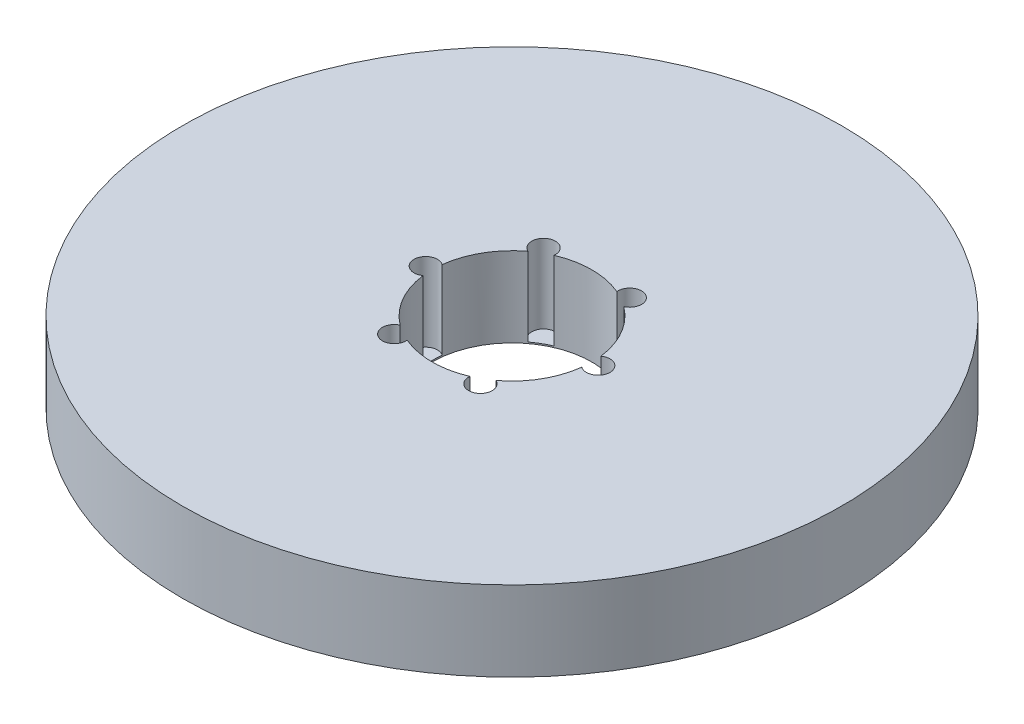
ISO-10303-21;
HEADER;
FILE_DESCRIPTION(('STEP AP214'),'2;1');
FILE_NAME('part.step','',(''),(''),'','','');
FILE_SCHEMA(('AUTOMOTIVE_DESIGN { 1 0 10303 214 1 1 1 1 }'));
ENDSEC;
DATA;
#1=APPLICATION_CONTEXT('core data for automotive mechanical design processes');
#2=APPLICATION_PROTOCOL_DEFINITION('international standard','automotive_design',2000,#1);
#3=PRODUCT_CONTEXT('',#1,'mechanical');
#4=PRODUCT('Part','Part','',(#3));
#5=PRODUCT_RELATED_PRODUCT_CATEGORY('part','',(#4));
#6=PRODUCT_DEFINITION_FORMATION('','',#4);
#7=PRODUCT_DEFINITION_CONTEXT('part definition',#1,'design');
#8=PRODUCT_DEFINITION('design','',#6,#7);
#9=PRODUCT_DEFINITION_SHAPE('','',#8);
#10=(LENGTH_UNIT() NAMED_UNIT(*) SI_UNIT(.MILLI.,.METRE.));
#11=(NAMED_UNIT(*) PLANE_ANGLE_UNIT() SI_UNIT($,.RADIAN.));
#12=(NAMED_UNIT(*) SI_UNIT($,.STERADIAN.) SOLID_ANGLE_UNIT());
#13=UNCERTAINTY_MEASURE_WITH_UNIT(LENGTH_MEASURE(1.E-05),#10,'distance_accuracy_value','');
#14=(GEOMETRIC_REPRESENTATION_CONTEXT(3) GLOBAL_UNCERTAINTY_ASSIGNED_CONTEXT((#13)) GLOBAL_UNIT_ASSIGNED_CONTEXT((#10,
#11,#12)) REPRESENTATION_CONTEXT('',''));
#15=CARTESIAN_POINT('',(0.,0.,0.));
#16=DIRECTION('',(0.,0.,1.));
#17=DIRECTION('',(1.,0.,0.));
#18=AXIS2_PLACEMENT_3D('',#15,#16,#17);
#19=CARTESIAN_POINT('',(0.,20.,0.));
#20=DIRECTION('',(0.,-1.,0.));
#21=DIRECTION('',(0.,0.,-1.));
#22=AXIS2_PLACEMENT_3D('',#19,#20,#21);
#23=CYLINDRICAL_SURFACE('',#22,82.5);
#24=CARTESIAN_POINT('',(0.,20.,0.));
#25=DIRECTION('',(0.,1.,0.));
#26=DIRECTION('',(0.,0.,1.));
#27=AXIS2_PLACEMENT_3D('',#24,#25,#26);
#28=CIRCLE('',#27,82.5);
#29=CARTESIAN_POINT('',(0.,20.,82.5));
#30=VERTEX_POINT('',#29);
#31=EDGE_CURVE('E171',#30,#30,#28,.T.);
#32=ORIENTED_EDGE('',*,*,#31,.F.);
#33=EDGE_LOOP('',(#32));
#34=FACE_BOUND('',#33,.T.);
#35=CARTESIAN_POINT('',(0.,0.,0.));
#36=DIRECTION('',(0.,1.,0.));
#37=DIRECTION('',(0.,0.,1.));
#38=AXIS2_PLACEMENT_3D('',#35,#36,#37);
#39=CIRCLE('',#38,82.5);
#40=CARTESIAN_POINT('',(0.,0.,82.5));
#41=VERTEX_POINT('',#40);
#42=EDGE_CURVE('E157',#41,#41,#39,.T.);
#43=ORIENTED_EDGE('',*,*,#42,.T.);
#44=EDGE_LOOP('',(#43));
#45=FACE_BOUND('',#44,.T.);
#46=ADVANCED_FACE('F39',(#34,#45),#23,.T.);
#47=CARTESIAN_POINT('',(0.,20.,0.));
#48=DIRECTION('',(0.,1.,0.));
#49=DIRECTION('',(0.,0.,1.));
#50=AXIS2_PLACEMENT_3D('',#47,#48,#49);
#51=PLANE('',#50);
#52=CARTESIAN_POINT('',(-10.7906424450801,20.,-18.6899409611874));
#53=DIRECTION('',(0.,1.,0.));
#54=DIRECTION('',(-0.866025403784433,0.,0.50000000000001));
#55=AXIS2_PLACEMENT_3D('',#52,#53,#54);
#56=CIRCLE('',#55,2.94707210080834);
#57=CARTESIAN_POINT('',(-7.85873994580773,20.,-18.391307905208));
#58=VERTEX_POINT('',#57);
#59=CARTESIAN_POINT('',(-11.9979698818282,20.,-16.0015223874088));
#60=VERTEX_POINT('',#59);
#61=EDGE_CURVE('E214',#58,#60,#56,.T.);
#62=ORIENTED_EDGE('',*,*,#61,.F.);
#63=CARTESIAN_POINT('',(0.,20.,0.));
#64=DIRECTION('',(0.,1.,0.));
#65=DIRECTION('',(0.,0.,1.));
#66=AXIS2_PLACEMENT_3D('',#63,#64,#65);
#67=CIRCLE('',#66,20.);
#68=CARTESIAN_POINT('',(7.85873994580735,20.,-18.3913079052082));
#69=VERTEX_POINT('',#68);
#70=EDGE_CURVE('E272',#69,#58,#67,.T.);
#71=ORIENTED_EDGE('',*,*,#70,.F.);
#72=CARTESIAN_POINT('',(10.7906424450797,20.,-18.6899409611876));
#73=DIRECTION('',(0.,1.,0.));
#74=DIRECTION('',(-0.866025403784443,0.,-0.499999999999992));
#75=AXIS2_PLACEMENT_3D('',#72,#73,#74);
#76=CIRCLE('',#75,2.94707210080834);
#77=CARTESIAN_POINT('',(11.9979698818279,20.,-16.001522387409));
#78=VERTEX_POINT('',#77);
#79=EDGE_CURVE('E285',#78,#69,#76,.T.);
#80=ORIENTED_EDGE('',*,*,#79,.F.);
#81=CARTESIAN_POINT('',(19.8567098276355,20.,-2.38978551779919));
#82=VERTEX_POINT('',#81);
#83=EDGE_CURVE('E165',#82,#78,#67,.T.);
#84=ORIENTED_EDGE('',*,*,#83,.F.);
#85=CARTESIAN_POINT('',(21.5812848901597,20.,0.));
#86=DIRECTION('',(0.,1.,0.));
#87=DIRECTION('',(0.,0.,-1.));
#88=AXIS2_PLACEMENT_3D('',#85,#86,#87);
#89=CIRCLE('',#88,2.94707210080834);
#90=CARTESIAN_POINT('',(19.8567098276355,20.,2.38978551779919));
#91=VERTEX_POINT('',#90);
#92=EDGE_CURVE('E281',#91,#82,#89,.T.);
#93=ORIENTED_EDGE('',*,*,#92,.F.);
#94=CARTESIAN_POINT('',(11.9979698818281,20.,16.0015223874088));
#95=VERTEX_POINT('',#94);
#96=EDGE_CURVE('E160',#95,#91,#67,.T.);
#97=ORIENTED_EDGE('',*,*,#96,.F.);
#98=CARTESIAN_POINT('',(10.7906424450799,20.,18.6899409611875));
#99=DIRECTION('',(0.,1.,0.));
#100=DIRECTION('',(0.866025403784436,0.,-0.500000000000004));
#101=AXIS2_PLACEMENT_3D('',#98,#99,#100);
#102=CIRCLE('',#101,2.94707210080834);
#103=CARTESIAN_POINT('',(7.85873994580761,20.,18.391307905208));
#104=VERTEX_POINT('',#103);
#105=EDGE_CURVE('E154',#104,#95,#102,.T.);
#106=ORIENTED_EDGE('',*,*,#105,.F.);
#107=CARTESIAN_POINT('',(-7.85873994580748,20.,18.3913079052081));
#108=VERTEX_POINT('',#107);
#109=EDGE_CURVE('E150',#108,#104,#67,.T.);
#110=ORIENTED_EDGE('',*,*,#109,.F.);
#111=CARTESIAN_POINT('',(-10.7906424450798,20.,18.6899409611876));
#112=DIRECTION('',(0.,1.,0.));
#113=DIRECTION('',(0.86602540378444,0.,0.499999999999998));
#114=AXIS2_PLACEMENT_3D('',#111,#112,#113);
#115=CIRCLE('',#114,2.94707210080834);
#116=CARTESIAN_POINT('',(-11.997969881828,20.,16.0015223874089));
#117=VERTEX_POINT('',#116);
#118=EDGE_CURVE('E127',#117,#108,#115,.T.);
#119=ORIENTED_EDGE('',*,*,#118,.F.);
#120=CARTESIAN_POINT('',(-19.8567098276355,20.,2.38978551779919));
#121=VERTEX_POINT('',#120);
#122=EDGE_CURVE('E156',#121,#117,#67,.T.);
#123=ORIENTED_EDGE('',*,*,#122,.F.);
#124=CARTESIAN_POINT('',(-21.5812848901597,20.,0.));
#125=DIRECTION('',(0.,1.,0.));
#126=DIRECTION('',(0.,0.,1.));
#127=AXIS2_PLACEMENT_3D('',#124,#125,#126);
#128=CIRCLE('',#127,2.94707210080834);
#129=CARTESIAN_POINT('',(-19.8567098276355,20.,-2.38978551779919));
#130=VERTEX_POINT('',#129);
#131=EDGE_CURVE('E164',#130,#121,#128,.T.);
#132=ORIENTED_EDGE('',*,*,#131,.F.);
#133=EDGE_CURVE('E159',#60,#130,#67,.T.);
#134=ORIENTED_EDGE('',*,*,#133,.F.);
#135=EDGE_LOOP('',(#62,#71,#80,#84,#93,#97,#106,#110,#119,#123,#132,#134));
#136=FACE_BOUND('',#135,.T.);
#137=ORIENTED_EDGE('',*,*,#31,.T.);
#138=EDGE_LOOP('',(#137));
#139=FACE_BOUND('',#138,.T.);
#140=ADVANCED_FACE('F155',(#136,#139),#51,.T.);
#141=CARTESIAN_POINT('',(0.,0.,0.));
#142=DIRECTION('',(0.,1.,0.));
#143=DIRECTION('',(0.,0.,1.));
#144=AXIS2_PLACEMENT_3D('',#141,#142,#143);
#145=PLANE('',#144);
#146=CARTESIAN_POINT('',(0.,0.,0.));
#147=DIRECTION('',(0.,1.,0.));
#148=DIRECTION('',(0.,0.,1.));
#149=AXIS2_PLACEMENT_3D('',#146,#147,#148);
#150=CIRCLE('',#149,20.);
#151=CARTESIAN_POINT('',(0.,0.,20.));
#152=VERTEX_POINT('',#151);
#153=EDGE_CURVE('E170',#152,#152,#150,.T.);
#154=ORIENTED_EDGE('',*,*,#153,.T.);
#155=EDGE_LOOP('',(#154));
#156=FACE_BOUND('',#155,.T.);
#157=ORIENTED_EDGE('',*,*,#42,.F.);
#158=EDGE_LOOP('',(#157));
#159=FACE_BOUND('',#158,.T.);
#160=ADVANCED_FACE('F232',(#156,#159),#145,.F.);
#161=CARTESIAN_POINT('',(0.,20.,0.));
#162=DIRECTION('',(0.,-1.,0.));
#163=DIRECTION('',(0.,0.,-1.));
#164=AXIS2_PLACEMENT_3D('',#161,#162,#163);
#165=CYLINDRICAL_SURFACE('',#164,20.);
#166=DIRECTION('',(0.,1.,0.));
#167=VECTOR('',#166,1.);
#168=CARTESIAN_POINT('',(-7.85873994580773,10.1686329349,-18.391307905208));
#169=LINE('',#168,#167);
#170=CARTESIAN_POINT('',(-7.85873994580773,0.337265869800093,-18.391307905208));
#171=VERTEX_POINT('',#170);
#172=EDGE_CURVE('E11',#171,#58,#169,.T.);
#173=ORIENTED_EDGE('',*,*,#172,.F.);
#174=CARTESIAN_POINT('',(0.,0.337265869800093,0.));
#175=DIRECTION('',(0.,1.,0.));
#176=DIRECTION('',(0.,0.,1.));
#177=AXIS2_PLACEMENT_3D('',#174,#175,#176);
#178=CIRCLE('',#177,20.);
#179=CARTESIAN_POINT('',(-11.9979698818282,0.337265869800093,-16.0015223874088));
#180=VERTEX_POINT('',#179);
#181=EDGE_CURVE('E209',#171,#180,#178,.T.);
#182=ORIENTED_EDGE('',*,*,#181,.T.);
#183=DIRECTION('',(0.,1.,0.));
#184=VECTOR('',#183,1.);
#185=CARTESIAN_POINT('',(-11.9979698818282,10.1686329349,-16.0015223874088));
#186=LINE('',#185,#184);
#187=EDGE_CURVE('E46',#60,#180,#186,.F.);
#188=ORIENTED_EDGE('',*,*,#187,.F.);
#189=ORIENTED_EDGE('',*,*,#133,.T.);
#190=DIRECTION('',(0.,1.,0.));
#191=VECTOR('',#190,1.);
#192=CARTESIAN_POINT('',(-19.8567098276355,10.1686329349,-2.38978551779919));
#193=LINE('',#192,#191);
#194=CARTESIAN_POINT('',(-19.8567098276355,0.337265869800093,-2.38978551779919));
#195=VERTEX_POINT('',#194);
#196=EDGE_CURVE('E185',#195,#130,#193,.T.);
#197=ORIENTED_EDGE('',*,*,#196,.F.);
#198=CARTESIAN_POINT('',(0.,0.337265869800093,0.));
#199=DIRECTION('',(0.,1.,0.));
#200=DIRECTION('',(0.,0.,1.));
#201=AXIS2_PLACEMENT_3D('',#198,#199,#200);
#202=CIRCLE('',#201,20.);
#203=CARTESIAN_POINT('',(-19.8567098276355,0.337265869800093,2.38978551779919));
#204=VERTEX_POINT('',#203);
#205=EDGE_CURVE('E173',#195,#204,#202,.T.);
#206=ORIENTED_EDGE('',*,*,#205,.T.);
#207=DIRECTION('',(0.,1.,0.));
#208=VECTOR('',#207,1.);
#209=CARTESIAN_POINT('',(-19.8567098276355,10.1686329349,2.38978551779919));
#210=LINE('',#209,#208);
#211=EDGE_CURVE('E178',#121,#204,#210,.F.);
#212=ORIENTED_EDGE('',*,*,#211,.F.);
#213=ORIENTED_EDGE('',*,*,#122,.T.);
#214=DIRECTION('',(0.,1.,0.));
#215=VECTOR('',#214,1.);
#216=CARTESIAN_POINT('',(-11.997969881828,10.1686329349,16.0015223874089));
#217=LINE('',#216,#215);
#218=CARTESIAN_POINT('',(-11.997969881828,0.337265869800093,16.0015223874089));
#219=VERTEX_POINT('',#218);
#220=EDGE_CURVE('E132',#219,#117,#217,.T.);
#221=ORIENTED_EDGE('',*,*,#220,.F.);
#222=CARTESIAN_POINT('',(0.,0.337265869800093,0.));
#223=DIRECTION('',(0.,1.,0.));
#224=DIRECTION('',(0.,0.,1.));
#225=AXIS2_PLACEMENT_3D('',#222,#223,#224);
#226=CIRCLE('',#225,20.);
#227=CARTESIAN_POINT('',(-7.85873994580748,0.337265869800093,18.3913079052081));
#228=VERTEX_POINT('',#227);
#229=EDGE_CURVE('E146',#219,#228,#226,.T.);
#230=ORIENTED_EDGE('',*,*,#229,.T.);
#231=DIRECTION('',(0.,1.,0.));
#232=VECTOR('',#231,1.);
#233=CARTESIAN_POINT('',(-7.85873994580748,10.1686329349,18.3913079052081));
#234=LINE('',#233,#232);
#235=EDGE_CURVE('E128',#108,#228,#234,.F.);
#236=ORIENTED_EDGE('',*,*,#235,.F.);
#237=ORIENTED_EDGE('',*,*,#109,.T.);
#238=DIRECTION('',(0.,1.,0.));
#239=VECTOR('',#238,1.);
#240=CARTESIAN_POINT('',(7.85873994580761,10.1686329349,18.391307905208));
#241=LINE('',#240,#239);
#242=CARTESIAN_POINT('',(7.85873994580761,0.337265869800093,18.391307905208));
#243=VERTEX_POINT('',#242);
#244=EDGE_CURVE('E192',#243,#104,#241,.T.);
#245=ORIENTED_EDGE('',*,*,#244,.F.);
#246=CARTESIAN_POINT('',(0.,0.337265869800093,0.));
#247=DIRECTION('',(0.,1.,0.));
#248=DIRECTION('',(0.,0.,1.));
#249=AXIS2_PLACEMENT_3D('',#246,#247,#248);
#250=CIRCLE('',#249,20.);
#251=CARTESIAN_POINT('',(11.9979698818281,0.337265869800093,16.0015223874088));
#252=VERTEX_POINT('',#251);
#253=EDGE_CURVE('E190',#243,#252,#250,.T.);
#254=ORIENTED_EDGE('',*,*,#253,.T.);
#255=DIRECTION('',(0.,1.,0.));
#256=VECTOR('',#255,1.);
#257=CARTESIAN_POINT('',(11.9979698818281,10.1686329349,16.0015223874088));
#258=LINE('',#257,#256);
#259=EDGE_CURVE('E189',#95,#252,#258,.F.);
#260=ORIENTED_EDGE('',*,*,#259,.F.);
#261=ORIENTED_EDGE('',*,*,#96,.T.);
#262=DIRECTION('',(0.,1.,0.));
#263=VECTOR('',#262,1.);
#264=CARTESIAN_POINT('',(19.8567098276355,10.1686329349,2.38978551779919));
#265=LINE('',#264,#263);
#266=CARTESIAN_POINT('',(19.8567098276355,0.337265869800093,2.38978551779919));
#267=VERTEX_POINT('',#266);
#268=EDGE_CURVE('E203',#267,#91,#265,.T.);
#269=ORIENTED_EDGE('',*,*,#268,.F.);
#270=CARTESIAN_POINT('',(0.,0.337265869800093,0.));
#271=DIRECTION('',(0.,1.,0.));
#272=DIRECTION('',(0.,0.,1.));
#273=AXIS2_PLACEMENT_3D('',#270,#271,#272);
#274=CIRCLE('',#273,20.);
#275=CARTESIAN_POINT('',(19.8567098276355,0.337265869800093,-2.38978551779919));
#276=VERTEX_POINT('',#275);
#277=EDGE_CURVE('E194',#267,#276,#274,.T.);
#278=ORIENTED_EDGE('',*,*,#277,.T.);
#279=DIRECTION('',(0.,1.,0.));
#280=VECTOR('',#279,1.);
#281=CARTESIAN_POINT('',(19.8567098276355,10.1686329349,-2.38978551779919));
#282=LINE('',#281,#280);
#283=EDGE_CURVE('E196',#82,#276,#282,.F.);
#284=ORIENTED_EDGE('',*,*,#283,.F.);
#285=ORIENTED_EDGE('',*,*,#83,.T.);
#286=DIRECTION('',(0.,1.,0.));
#287=VECTOR('',#286,1.);
#288=CARTESIAN_POINT('',(11.9979698818279,10.1686329349,-16.001522387409));
#289=LINE('',#288,#287);
#290=CARTESIAN_POINT('',(11.9979698818279,0.337265869800093,-16.001522387409));
#291=VERTEX_POINT('',#290);
#292=EDGE_CURVE('E208',#291,#78,#289,.T.);
#293=ORIENTED_EDGE('',*,*,#292,.F.);
#294=CARTESIAN_POINT('',(0.,0.337265869800093,0.));
#295=DIRECTION('',(0.,1.,0.));
#296=DIRECTION('',(0.,0.,1.));
#297=AXIS2_PLACEMENT_3D('',#294,#295,#296);
#298=CIRCLE('',#297,20.);
#299=CARTESIAN_POINT('',(7.85873994580735,0.337265869800093,-18.3913079052082));
#300=VERTEX_POINT('',#299);
#301=EDGE_CURVE('E201',#291,#300,#298,.T.);
#302=ORIENTED_EDGE('',*,*,#301,.T.);
#303=DIRECTION('',(0.,1.,0.));
#304=VECTOR('',#303,1.);
#305=CARTESIAN_POINT('',(7.85873994580735,10.1686329349,-18.3913079052082));
#306=LINE('',#305,#304);
#307=EDGE_CURVE('E206',#69,#300,#306,.F.);
#308=ORIENTED_EDGE('',*,*,#307,.F.);
#309=ORIENTED_EDGE('',*,*,#70,.T.);
#310=EDGE_LOOP('',(#173,#182,#188,#189,#197,#206,#212,#213,#221,#230,#236,#237,#245,#254,#260,
#261,#269,#278,#284,#285,#293,#302,#308,#309));
#311=FACE_BOUND('',#310,.T.);
#312=ORIENTED_EDGE('',*,*,#153,.F.);
#313=EDGE_LOOP('',(#312));
#314=FACE_BOUND('',#313,.T.);
#315=ADVANCED_FACE('F145',(#311,#314),#165,.F.);
#316=CARTESIAN_POINT('',(-21.5812848901597,0.337265869800093,0.));
#317=DIRECTION('',(0.,1.,0.));
#318=DIRECTION('',(0.,0.,1.));
#319=AXIS2_PLACEMENT_3D('',#316,#317,#318);
#320=CYLINDRICAL_SURFACE('',#319,2.94707210080834);
#321=ORIENTED_EDGE('',*,*,#196,.T.);
#322=ORIENTED_EDGE('',*,*,#131,.T.);
#323=ORIENTED_EDGE('',*,*,#211,.T.);
#324=CARTESIAN_POINT('',(-21.5812848901597,0.337265869800093,0.));
#325=DIRECTION('',(0.,1.,0.));
#326=DIRECTION('',(0.,0.,1.));
#327=AXIS2_PLACEMENT_3D('',#324,#325,#326);
#328=CIRCLE('',#327,2.94707210080834);
#329=EDGE_CURVE('E168',#195,#204,#328,.T.);
#330=ORIENTED_EDGE('',*,*,#329,.F.);
#331=EDGE_LOOP('',(#321,#322,#323,#330));
#332=FACE_BOUND('',#331,.T.);
#333=ADVANCED_FACE('F243',(#332),#320,.F.);
#334=CARTESIAN_POINT('',(-21.5812848901597,0.337265869800093,0.));
#335=DIRECTION('',(0.,1.,0.));
#336=DIRECTION('',(0.,0.,1.));
#337=AXIS2_PLACEMENT_3D('',#334,#335,#336);
#338=PLANE('',#337);
#339=ORIENTED_EDGE('',*,*,#329,.T.);
#340=ORIENTED_EDGE('',*,*,#205,.F.);
#341=EDGE_LOOP('',(#339,#340));
#342=FACE_BOUND('',#341,.T.);
#343=ADVANCED_FACE('F247',(#342),#338,.T.);
#344=CARTESIAN_POINT('',(-10.7906424450798,0.337265869800093,18.6899409611876));
#345=DIRECTION('',(0.,1.,0.));
#346=DIRECTION('',(0.,0.,1.));
#347=AXIS2_PLACEMENT_3D('',#344,#345,#346);
#348=CYLINDRICAL_SURFACE('',#347,2.94707210080834);
#349=ORIENTED_EDGE('',*,*,#220,.T.);
#350=ORIENTED_EDGE('',*,*,#118,.T.);
#351=ORIENTED_EDGE('',*,*,#235,.T.);
#352=CARTESIAN_POINT('',(-10.7906424450798,0.337265869800093,18.6899409611876));
#353=DIRECTION('',(0.,1.,0.));
#354=DIRECTION('',(0.86602540378444,0.,0.499999999999998));
#355=AXIS2_PLACEMENT_3D('',#352,#353,#354);
#356=CIRCLE('',#355,2.94707210080834);
#357=EDGE_CURVE('E137',#219,#228,#356,.T.);
#358=ORIENTED_EDGE('',*,*,#357,.F.);
#359=EDGE_LOOP('',(#349,#350,#351,#358));
#360=FACE_BOUND('',#359,.T.);
#361=ADVANCED_FACE('F126',(#360),#348,.F.);
#362=CARTESIAN_POINT('',(-10.7906424450798,0.337265869800093,18.6899409611876));
#363=DIRECTION('',(0.,1.,0.));
#364=DIRECTION('',(0.86602540378444,0.,0.499999999999998));
#365=AXIS2_PLACEMENT_3D('',#362,#363,#364);
#366=PLANE('',#365);
#367=ORIENTED_EDGE('',*,*,#357,.T.);
#368=ORIENTED_EDGE('',*,*,#229,.F.);
#369=EDGE_LOOP('',(#367,#368));
#370=FACE_BOUND('',#369,.T.);
#371=ADVANCED_FACE('F254',(#370),#366,.T.);
#372=CARTESIAN_POINT('',(10.7906424450799,0.337265869800093,18.6899409611875));
#373=DIRECTION('',(0.,1.,0.));
#374=DIRECTION('',(0.,0.,1.));
#375=AXIS2_PLACEMENT_3D('',#372,#373,#374);
#376=CYLINDRICAL_SURFACE('',#375,2.94707210080834);
#377=ORIENTED_EDGE('',*,*,#244,.T.);
#378=ORIENTED_EDGE('',*,*,#105,.T.);
#379=ORIENTED_EDGE('',*,*,#259,.T.);
#380=CARTESIAN_POINT('',(10.7906424450799,0.337265869800093,18.6899409611875));
#381=DIRECTION('',(0.,1.,0.));
#382=DIRECTION('',(0.866025403784436,0.,-0.500000000000004));
#383=AXIS2_PLACEMENT_3D('',#380,#381,#382);
#384=CIRCLE('',#383,2.94707210080834);
#385=EDGE_CURVE('E138',#243,#252,#384,.T.);
#386=ORIENTED_EDGE('',*,*,#385,.F.);
#387=EDGE_LOOP('',(#377,#378,#379,#386));
#388=FACE_BOUND('',#387,.T.);
#389=ADVANCED_FACE('F260',(#388),#376,.F.);
#390=CARTESIAN_POINT('',(10.7906424450799,0.337265869800093,18.6899409611875));
#391=DIRECTION('',(0.,1.,0.));
#392=DIRECTION('',(0.866025403784436,0.,-0.500000000000004));
#393=AXIS2_PLACEMENT_3D('',#390,#391,#392);
#394=PLANE('',#393);
#395=ORIENTED_EDGE('',*,*,#385,.T.);
#396=ORIENTED_EDGE('',*,*,#253,.F.);
#397=EDGE_LOOP('',(#395,#396));
#398=FACE_BOUND('',#397,.T.);
#399=ADVANCED_FACE('F265',(#398),#394,.T.);
#400=CARTESIAN_POINT('',(21.5812848901597,0.337265869800093,0.));
#401=DIRECTION('',(0.,1.,0.));
#402=DIRECTION('',(0.,0.,1.));
#403=AXIS2_PLACEMENT_3D('',#400,#401,#402);
#404=CYLINDRICAL_SURFACE('',#403,2.94707210080834);
#405=ORIENTED_EDGE('',*,*,#268,.T.);
#406=ORIENTED_EDGE('',*,*,#92,.T.);
#407=ORIENTED_EDGE('',*,*,#283,.T.);
#408=CARTESIAN_POINT('',(21.5812848901597,0.337265869800093,0.));
#409=DIRECTION('',(0.,1.,0.));
#410=DIRECTION('',(0.,0.,-1.));
#411=AXIS2_PLACEMENT_3D('',#408,#409,#410);
#412=CIRCLE('',#411,2.94707210080834);
#413=EDGE_CURVE('E287',#267,#276,#412,.T.);
#414=ORIENTED_EDGE('',*,*,#413,.F.);
#415=EDGE_LOOP('',(#405,#406,#407,#414));
#416=FACE_BOUND('',#415,.T.);
#417=ADVANCED_FACE('F300',(#416),#404,.F.);
#418=CARTESIAN_POINT('',(21.5812848901597,0.337265869800093,0.));
#419=DIRECTION('',(0.,1.,0.));
#420=DIRECTION('',(0.,0.,-1.));
#421=AXIS2_PLACEMENT_3D('',#418,#419,#420);
#422=PLANE('',#421);
#423=ORIENTED_EDGE('',*,*,#413,.T.);
#424=ORIENTED_EDGE('',*,*,#277,.F.);
#425=EDGE_LOOP('',(#423,#424));
#426=FACE_BOUND('',#425,.T.);
#427=ADVANCED_FACE('F298',(#426),#422,.T.);
#428=CARTESIAN_POINT('',(10.7906424450797,0.337265869800093,-18.6899409611876));
#429=DIRECTION('',(0.,1.,0.));
#430=DIRECTION('',(0.,0.,1.));
#431=AXIS2_PLACEMENT_3D('',#428,#429,#430);
#432=CYLINDRICAL_SURFACE('',#431,2.94707210080834);
#433=ORIENTED_EDGE('',*,*,#292,.T.);
#434=ORIENTED_EDGE('',*,*,#79,.T.);
#435=ORIENTED_EDGE('',*,*,#307,.T.);
#436=CARTESIAN_POINT('',(10.7906424450797,0.337265869800093,-18.6899409611876));
#437=DIRECTION('',(0.,1.,0.));
#438=DIRECTION('',(-0.866025403784443,0.,-0.499999999999992));
#439=AXIS2_PLACEMENT_3D('',#436,#437,#438);
#440=CIRCLE('',#439,2.94707210080834);
#441=EDGE_CURVE('E56',#291,#300,#440,.T.);
#442=ORIENTED_EDGE('',*,*,#441,.F.);
#443=EDGE_LOOP('',(#433,#434,#435,#442));
#444=FACE_BOUND('',#443,.T.);
#445=ADVANCED_FACE('F301',(#444),#432,.F.);
#446=CARTESIAN_POINT('',(10.7906424450797,0.337265869800093,-18.6899409611876));
#447=DIRECTION('',(0.,1.,0.));
#448=DIRECTION('',(-0.866025403784443,0.,-0.499999999999992));
#449=AXIS2_PLACEMENT_3D('',#446,#447,#448);
#450=PLANE('',#449);
#451=ORIENTED_EDGE('',*,*,#441,.T.);
#452=ORIENTED_EDGE('',*,*,#301,.F.);
#453=EDGE_LOOP('',(#451,#452));
#454=FACE_BOUND('',#453,.T.);
#455=ADVANCED_FACE('F221',(#454),#450,.T.);
#456=CARTESIAN_POINT('',(-10.7906424450801,0.337265869800093,-18.6899409611874));
#457=DIRECTION('',(0.,1.,0.));
#458=DIRECTION('',(0.,0.,1.));
#459=AXIS2_PLACEMENT_3D('',#456,#457,#458);
#460=CYLINDRICAL_SURFACE('',#459,2.94707210080834);
#461=ORIENTED_EDGE('',*,*,#172,.T.);
#462=ORIENTED_EDGE('',*,*,#61,.T.);
#463=ORIENTED_EDGE('',*,*,#187,.T.);
#464=CARTESIAN_POINT('',(-10.7906424450801,0.337265869800093,-18.6899409611874));
#465=DIRECTION('',(0.,1.,0.));
#466=DIRECTION('',(-0.866025403784433,0.,0.50000000000001));
#467=AXIS2_PLACEMENT_3D('',#464,#465,#466);
#468=CIRCLE('',#467,2.94707210080834);
#469=EDGE_CURVE('E55',#171,#180,#468,.T.);
#470=ORIENTED_EDGE('',*,*,#469,.F.);
#471=EDGE_LOOP('',(#461,#462,#463,#470));
#472=FACE_BOUND('',#471,.T.);
#473=ADVANCED_FACE('F212',(#472),#460,.F.);
#474=CARTESIAN_POINT('',(-10.7906424450801,0.337265869800093,-18.6899409611874));
#475=DIRECTION('',(0.,1.,0.));
#476=DIRECTION('',(-0.866025403784433,0.,0.50000000000001));
#477=AXIS2_PLACEMENT_3D('',#474,#475,#476);
#478=PLANE('',#477);
#479=ORIENTED_EDGE('',*,*,#469,.T.);
#480=ORIENTED_EDGE('',*,*,#181,.F.);
#481=EDGE_LOOP('',(#479,#480));
#482=FACE_BOUND('',#481,.T.);
#483=ADVANCED_FACE('F217',(#482),#478,.T.);
#484=CLOSED_SHELL('',(#46,#140,#160,#315,#333,#343,#361,#371,#389,#399,#417,#427,#445,#455,#473,#483));
#485=MANIFOLD_SOLID_BREP('B2',#484);
#486=ADVANCED_BREP_SHAPE_REPRESENTATION('',(#18,#485),#14);
#487=SHAPE_DEFINITION_REPRESENTATION(#9,#486);
ENDSEC;
END-ISO-10303-21;
